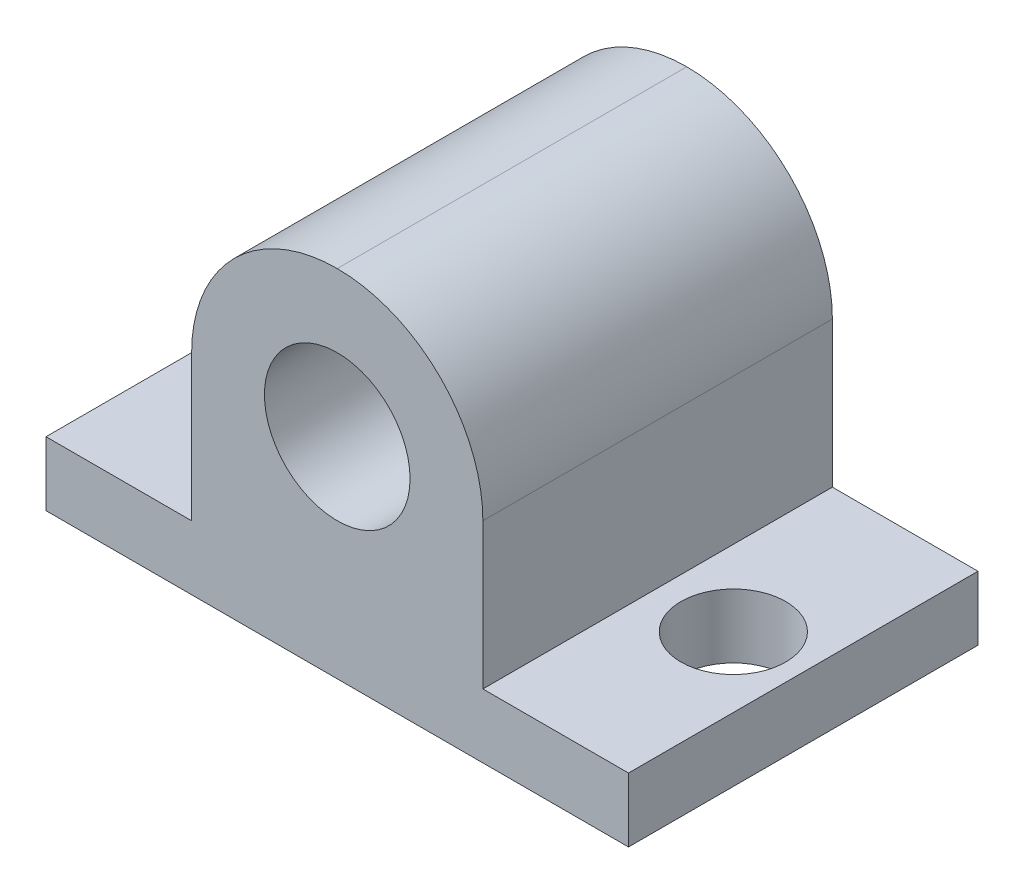
ISO-10303-21;
HEADER;
FILE_DESCRIPTION(('STEP AP214'),'2;1');
FILE_NAME('part.step','',(''),(''),'','','');
FILE_SCHEMA(('AUTOMOTIVE_DESIGN { 1 0 10303 214 1 1 1 1 }'));
ENDSEC;
DATA;
#1=APPLICATION_CONTEXT('core data for automotive mechanical design processes');
#2=APPLICATION_PROTOCOL_DEFINITION('international standard','automotive_design',2000,#1);
#3=PRODUCT_CONTEXT('',#1,'mechanical');
#4=PRODUCT('Part','Part','',(#3));
#5=PRODUCT_RELATED_PRODUCT_CATEGORY('part','',(#4));
#6=PRODUCT_DEFINITION_FORMATION('','',#4);
#7=PRODUCT_DEFINITION_CONTEXT('part definition',#1,'design');
#8=PRODUCT_DEFINITION('design','',#6,#7);
#9=PRODUCT_DEFINITION_SHAPE('','',#8);
#10=(LENGTH_UNIT() NAMED_UNIT(*) SI_UNIT(.MILLI.,.METRE.));
#11=(NAMED_UNIT(*) PLANE_ANGLE_UNIT() SI_UNIT($,.RADIAN.));
#12=(NAMED_UNIT(*) SI_UNIT($,.STERADIAN.) SOLID_ANGLE_UNIT());
#13=UNCERTAINTY_MEASURE_WITH_UNIT(LENGTH_MEASURE(1.E-05),#10,'distance_accuracy_value','');
#14=(GEOMETRIC_REPRESENTATION_CONTEXT(3) GLOBAL_UNCERTAINTY_ASSIGNED_CONTEXT((#13)) GLOBAL_UNIT_ASSIGNED_CONTEXT((#10,
#11,#12)) REPRESENTATION_CONTEXT('',''));
#15=CARTESIAN_POINT('',(0.,0.,0.));
#16=DIRECTION('',(0.,0.,1.));
#17=DIRECTION('',(1.,0.,0.));
#18=AXIS2_PLACEMENT_3D('',#15,#16,#17);
#19=CARTESIAN_POINT('',(0.,2.794,0.));
#20=DIRECTION('',(0.,-1.,0.));
#21=DIRECTION('',(0.,0.,-1.));
#22=AXIS2_PLACEMENT_3D('',#19,#20,#21);
#23=PLANE('',#22);
#24=CARTESIAN_POINT('',(3.04799999999999,2.794,-7.62));
#25=DIRECTION('',(0.,1.,0.));
#26=DIRECTION('',(0.,0.,1.));
#27=AXIS2_PLACEMENT_3D('',#24,#25,#26);
#28=CIRCLE('',#27,2.286);
#29=CARTESIAN_POINT('',(3.04799999999999,2.794,-5.334));
#30=VERTEX_POINT('',#29);
#31=EDGE_CURVE('E205',#30,#30,#28,.T.);
#32=ORIENTED_EDGE('',*,*,#31,.F.);
#33=EDGE_LOOP('',(#32));
#34=FACE_BOUND('',#33,.T.);
#35=DIRECTION('',(0.,0.,1.));
#36=VECTOR('',#35,1.);
#37=CARTESIAN_POINT('',(6.34999999999999,2.794,-15.24));
#38=LINE('',#37,#36);
#39=CARTESIAN_POINT('',(6.34999999999999,2.794,-15.24));
#40=VERTEX_POINT('',#39);
#41=CARTESIAN_POINT('',(6.34999999999999,2.794,0.));
#42=VERTEX_POINT('',#41);
#43=EDGE_CURVE('E126',#40,#42,#38,.T.);
#44=ORIENTED_EDGE('',*,*,#43,.F.);
#45=DIRECTION('',(-1.,0.,0.));
#46=VECTOR('',#45,1.);
#47=CARTESIAN_POINT('',(0.,2.794,-15.24));
#48=LINE('',#47,#46);
#49=CARTESIAN_POINT('',(0.,2.794,-15.24));
#50=VERTEX_POINT('',#49);
#51=EDGE_CURVE('E122',#40,#50,#48,.T.);
#52=ORIENTED_EDGE('',*,*,#51,.T.);
#53=DIRECTION('',(0.,0.,1.));
#54=VECTOR('',#53,1.);
#55=CARTESIAN_POINT('',(0.,2.794,0.));
#56=LINE('',#55,#54);
#57=CARTESIAN_POINT('',(0.,2.794,0.));
#58=VERTEX_POINT('',#57);
#59=EDGE_CURVE('E137',#50,#58,#56,.T.);
#60=ORIENTED_EDGE('',*,*,#59,.T.);
#61=DIRECTION('',(1.,0.,0.));
#62=VECTOR('',#61,1.);
#63=CARTESIAN_POINT('',(0.,2.794,0.));
#64=LINE('',#63,#62);
#65=EDGE_CURVE('E142',#58,#42,#64,.T.);
#66=ORIENTED_EDGE('',*,*,#65,.T.);
#67=EDGE_LOOP('',(#44,#52,#60,#66));
#68=FACE_BOUND('',#67,.T.);
#69=ADVANCED_FACE('F36',(#34,#68),#23,.F.);
#70=CARTESIAN_POINT('',(22.352,2.794,-7.62));
#71=DIRECTION('',(0.,1.,0.));
#72=DIRECTION('',(0.,0.,1.));
#73=AXIS2_PLACEMENT_3D('',#70,#71,#72);
#74=CIRCLE('',#73,2.286);
#75=CARTESIAN_POINT('',(22.352,2.794,-5.334));
#76=VERTEX_POINT('',#75);
#77=EDGE_CURVE('E199',#76,#76,#74,.T.);
#78=ORIENTED_EDGE('',*,*,#77,.F.);
#79=EDGE_LOOP('',(#78));
#80=FACE_BOUND('',#79,.T.);
#81=DIRECTION('',(0.,0.,-1.));
#82=VECTOR('',#81,1.);
#83=CARTESIAN_POINT('',(19.05,2.794,-15.24));
#84=LINE('',#83,#82);
#85=CARTESIAN_POINT('',(19.05,2.794,0.));
#86=VERTEX_POINT('',#85);
#87=CARTESIAN_POINT('',(19.05,2.794,-15.24));
#88=VERTEX_POINT('',#87);
#89=EDGE_CURVE('E116',#86,#88,#84,.T.);
#90=ORIENTED_EDGE('',*,*,#89,.F.);
#91=CARTESIAN_POINT('',(25.4,2.794,0.));
#92=VERTEX_POINT('',#91);
#93=EDGE_CURVE('E140',#86,#92,#64,.T.);
#94=ORIENTED_EDGE('',*,*,#93,.T.);
#95=DIRECTION('',(0.,0.,-1.));
#96=VECTOR('',#95,1.);
#97=CARTESIAN_POINT('',(25.4,2.794,0.));
#98=LINE('',#97,#96);
#99=CARTESIAN_POINT('',(25.4,2.794,-15.24));
#100=VERTEX_POINT('',#99);
#101=EDGE_CURVE('E119',#92,#100,#98,.T.);
#102=ORIENTED_EDGE('',*,*,#101,.T.);
#103=EDGE_CURVE('E106',#100,#88,#48,.T.);
#104=ORIENTED_EDGE('',*,*,#103,.T.);
#105=EDGE_LOOP('',(#90,#94,#102,#104));
#106=FACE_BOUND('',#105,.T.);
#107=ADVANCED_FACE('F115',(#80,#106),#23,.F.);
#108=CARTESIAN_POINT('',(0.,2.794,0.));
#109=DIRECTION('',(1.,0.,0.));
#110=DIRECTION('',(0.,0.,-1.));
#111=AXIS2_PLACEMENT_3D('',#108,#109,#110);
#112=PLANE('',#111);
#113=DIRECTION('',(0.,0.,1.));
#114=VECTOR('',#113,1.);
#115=CARTESIAN_POINT('',(0.,0.,0.));
#116=LINE('',#115,#114);
#117=CARTESIAN_POINT('',(0.,0.,-15.24));
#118=VERTEX_POINT('',#117);
#119=CARTESIAN_POINT('',(0.,0.,0.));
#120=VERTEX_POINT('',#119);
#121=EDGE_CURVE('E136',#118,#120,#116,.T.);
#122=ORIENTED_EDGE('',*,*,#121,.T.);
#123=DIRECTION('',(0.,-1.,0.));
#124=VECTOR('',#123,1.);
#125=CARTESIAN_POINT('',(0.,2.794,0.));
#126=LINE('',#125,#124);
#127=EDGE_CURVE('E160',#58,#120,#126,.T.);
#128=ORIENTED_EDGE('',*,*,#127,.F.);
#129=ORIENTED_EDGE('',*,*,#59,.F.);
#130=DIRECTION('',(0.,-1.,0.));
#131=VECTOR('',#130,1.);
#132=CARTESIAN_POINT('',(0.,2.794,-15.24));
#133=LINE('',#132,#131);
#134=EDGE_CURVE('E121',#50,#118,#133,.T.);
#135=ORIENTED_EDGE('',*,*,#134,.T.);
#136=EDGE_LOOP('',(#122,#128,#129,#135));
#137=FACE_BOUND('',#136,.T.);
#138=ADVANCED_FACE('F226',(#137),#112,.F.);
#139=CARTESIAN_POINT('',(0.,2.794,0.));
#140=DIRECTION('',(0.,0.,-1.));
#141=DIRECTION('',(-1.,0.,0.));
#142=AXIS2_PLACEMENT_3D('',#139,#140,#141);
#143=PLANE('',#142);
#144=CARTESIAN_POINT('',(12.7,9.144,0.));
#145=DIRECTION('',(0.,0.,1.));
#146=DIRECTION('',(1.,0.,0.));
#147=AXIS2_PLACEMENT_3D('',#144,#145,#146);
#148=CIRCLE('',#147,3.175);
#149=CARTESIAN_POINT('',(15.875,9.144,0.));
#150=VERTEX_POINT('',#149);
#151=EDGE_CURVE('E192',#150,#150,#148,.T.);
#152=ORIENTED_EDGE('',*,*,#151,.F.);
#153=EDGE_LOOP('',(#152));
#154=FACE_BOUND('',#153,.T.);
#155=CARTESIAN_POINT('',(12.7,9.144,0.));
#156=DIRECTION('',(0.,0.,-1.));
#157=DIRECTION('',(-1.,0.,0.));
#158=AXIS2_PLACEMENT_3D('',#155,#156,#157);
#159=CIRCLE('',#158,6.35);
#160=CARTESIAN_POINT('',(19.05,9.144,0.));
#161=VERTEX_POINT('',#160);
#162=CARTESIAN_POINT('',(12.7,15.494,0.));
#163=VERTEX_POINT('',#162);
#164=EDGE_CURVE('E163',#161,#163,#159,.F.);
#165=ORIENTED_EDGE('',*,*,#164,.T.);
#166=CARTESIAN_POINT('',(12.7,9.144,0.));
#167=DIRECTION('',(0.,0.,-1.));
#168=DIRECTION('',(-1.,0.,0.));
#169=AXIS2_PLACEMENT_3D('',#166,#167,#168);
#170=CIRCLE('',#169,6.35);
#171=CARTESIAN_POINT('',(6.34999999999999,9.144,0.));
#172=VERTEX_POINT('',#171);
#173=EDGE_CURVE('E165',#163,#172,#170,.F.);
#174=ORIENTED_EDGE('',*,*,#173,.T.);
#175=DIRECTION('',(0.,-1.,0.));
#176=VECTOR('',#175,1.);
#177=CARTESIAN_POINT('',(6.34999999999999,15.494,0.));
#178=LINE('',#177,#176);
#179=EDGE_CURVE('E134',#172,#42,#178,.T.);
#180=ORIENTED_EDGE('',*,*,#179,.T.);
#181=ORIENTED_EDGE('',*,*,#65,.F.);
#182=ORIENTED_EDGE('',*,*,#127,.T.);
#183=DIRECTION('',(1.,0.,0.));
#184=VECTOR('',#183,1.);
#185=CARTESIAN_POINT('',(0.,0.,0.));
#186=LINE('',#185,#184);
#187=CARTESIAN_POINT('',(25.4,0.,0.));
#188=VERTEX_POINT('',#187);
#189=EDGE_CURVE('E148',#120,#188,#186,.T.);
#190=ORIENTED_EDGE('',*,*,#189,.T.);
#191=DIRECTION('',(0.,-1.,0.));
#192=VECTOR('',#191,1.);
#193=CARTESIAN_POINT('',(25.4,2.794,0.));
#194=LINE('',#193,#192);
#195=EDGE_CURVE('E157',#92,#188,#194,.T.);
#196=ORIENTED_EDGE('',*,*,#195,.F.);
#197=ORIENTED_EDGE('',*,*,#93,.F.);
#198=DIRECTION('',(0.,-1.,0.));
#199=VECTOR('',#198,1.);
#200=CARTESIAN_POINT('',(19.05,15.494,0.));
#201=LINE('',#200,#199);
#202=EDGE_CURVE('E110',#161,#86,#201,.T.);
#203=ORIENTED_EDGE('',*,*,#202,.F.);
#204=EDGE_LOOP('',(#165,#174,#180,#181,#182,#190,#196,#197,#203));
#205=FACE_BOUND('',#204,.T.);
#206=ADVANCED_FACE('F184',(#154,#205),#143,.F.);
#207=CARTESIAN_POINT('',(25.4,2.794,0.));
#208=DIRECTION('',(-1.,0.,0.));
#209=DIRECTION('',(0.,0.,1.));
#210=AXIS2_PLACEMENT_3D('',#207,#208,#209);
#211=PLANE('',#210);
#212=DIRECTION('',(0.,0.,-1.));
#213=VECTOR('',#212,1.);
#214=CARTESIAN_POINT('',(25.4,0.,0.));
#215=LINE('',#214,#213);
#216=CARTESIAN_POINT('',(25.4,0.,-15.24));
#217=VERTEX_POINT('',#216);
#218=EDGE_CURVE('E150',#188,#217,#215,.T.);
#219=ORIENTED_EDGE('',*,*,#218,.T.);
#220=DIRECTION('',(0.,-1.,0.));
#221=VECTOR('',#220,1.);
#222=CARTESIAN_POINT('',(25.4,2.794,-15.24));
#223=LINE('',#222,#221);
#224=EDGE_CURVE('E155',#100,#217,#223,.T.);
#225=ORIENTED_EDGE('',*,*,#224,.F.);
#226=ORIENTED_EDGE('',*,*,#101,.F.);
#227=ORIENTED_EDGE('',*,*,#195,.T.);
#228=EDGE_LOOP('',(#219,#225,#226,#227));
#229=FACE_BOUND('',#228,.T.);
#230=ADVANCED_FACE('F235',(#229),#211,.F.);
#231=CARTESIAN_POINT('',(0.,2.794,-15.24));
#232=DIRECTION('',(0.,0.,1.));
#233=DIRECTION('',(1.,0.,0.));
#234=AXIS2_PLACEMENT_3D('',#231,#232,#233);
#235=PLANE('',#234);
#236=CARTESIAN_POINT('',(12.7,9.144,-15.24));
#237=DIRECTION('',(0.,0.,1.));
#238=DIRECTION('',(1.,0.,0.));
#239=AXIS2_PLACEMENT_3D('',#236,#237,#238);
#240=CIRCLE('',#239,3.175);
#241=CARTESIAN_POINT('',(15.875,9.144,-15.24));
#242=VERTEX_POINT('',#241);
#243=EDGE_CURVE('E190',#242,#242,#240,.T.);
#244=ORIENTED_EDGE('',*,*,#243,.T.);
#245=EDGE_LOOP('',(#244));
#246=FACE_BOUND('',#245,.T.);
#247=DIRECTION('',(0.,-1.,0.));
#248=VECTOR('',#247,1.);
#249=CARTESIAN_POINT('',(6.34999999999999,15.494,-15.24));
#250=LINE('',#249,#248);
#251=CARTESIAN_POINT('',(6.34999999999999,9.144,-15.24));
#252=VERTEX_POINT('',#251);
#253=EDGE_CURVE('E111',#252,#40,#250,.T.);
#254=ORIENTED_EDGE('',*,*,#253,.F.);
#255=CARTESIAN_POINT('',(12.7,9.144,-15.24));
#256=DIRECTION('',(0.,0.,1.));
#257=DIRECTION('',(1.,0.,0.));
#258=AXIS2_PLACEMENT_3D('',#255,#256,#257);
#259=CIRCLE('',#258,6.35);
#260=CARTESIAN_POINT('',(12.7,15.494,-15.24));
#261=VERTEX_POINT('',#260);
#262=EDGE_CURVE('E45',#252,#261,#259,.F.);
#263=ORIENTED_EDGE('',*,*,#262,.T.);
#264=CARTESIAN_POINT('',(12.7,9.144,-15.24));
#265=DIRECTION('',(0.,0.,1.));
#266=DIRECTION('',(1.,0.,0.));
#267=AXIS2_PLACEMENT_3D('',#264,#265,#266);
#268=CIRCLE('',#267,6.35);
#269=CARTESIAN_POINT('',(19.05,9.144,-15.24));
#270=VERTEX_POINT('',#269);
#271=EDGE_CURVE('E52',#261,#270,#268,.F.);
#272=ORIENTED_EDGE('',*,*,#271,.T.);
#273=DIRECTION('',(0.,-1.,0.));
#274=VECTOR('',#273,1.);
#275=CARTESIAN_POINT('',(19.05,15.494,-15.24));
#276=LINE('',#275,#274);
#277=EDGE_CURVE('E102',#270,#88,#276,.T.);
#278=ORIENTED_EDGE('',*,*,#277,.T.);
#279=ORIENTED_EDGE('',*,*,#103,.F.);
#280=ORIENTED_EDGE('',*,*,#224,.T.);
#281=DIRECTION('',(-1.,0.,0.));
#282=VECTOR('',#281,1.);
#283=CARTESIAN_POINT('',(0.,0.,-15.24));
#284=LINE('',#283,#282);
#285=EDGE_CURVE('E141',#217,#118,#284,.T.);
#286=ORIENTED_EDGE('',*,*,#285,.T.);
#287=ORIENTED_EDGE('',*,*,#134,.F.);
#288=ORIENTED_EDGE('',*,*,#51,.F.);
#289=EDGE_LOOP('',(#254,#263,#272,#278,#279,#280,#286,#287,#288));
#290=FACE_BOUND('',#289,.T.);
#291=ADVANCED_FACE('F104',(#246,#290),#235,.F.);
#292=CARTESIAN_POINT('',(0.,0.,0.));
#293=DIRECTION('',(0.,-1.,0.));
#294=DIRECTION('',(0.,0.,-1.));
#295=AXIS2_PLACEMENT_3D('',#292,#293,#294);
#296=PLANE('',#295);
#297=CARTESIAN_POINT('',(3.04799999999999,0.,-7.62));
#298=DIRECTION('',(0.,1.,0.));
#299=DIRECTION('',(0.,0.,1.));
#300=AXIS2_PLACEMENT_3D('',#297,#298,#299);
#301=CIRCLE('',#300,2.286);
#302=CARTESIAN_POINT('',(3.04799999999999,0.,-5.334));
#303=VERTEX_POINT('',#302);
#304=EDGE_CURVE('E197',#303,#303,#301,.T.);
#305=ORIENTED_EDGE('',*,*,#304,.T.);
#306=EDGE_LOOP('',(#305));
#307=FACE_BOUND('',#306,.T.);
#308=CARTESIAN_POINT('',(22.352,0.,-7.62));
#309=DIRECTION('',(0.,1.,0.));
#310=DIRECTION('',(0.,0.,1.));
#311=AXIS2_PLACEMENT_3D('',#308,#309,#310);
#312=CIRCLE('',#311,2.286);
#313=CARTESIAN_POINT('',(22.352,0.,-5.334));
#314=VERTEX_POINT('',#313);
#315=EDGE_CURVE('E202',#314,#314,#312,.T.);
#316=ORIENTED_EDGE('',*,*,#315,.T.);
#317=EDGE_LOOP('',(#316));
#318=FACE_BOUND('',#317,.T.);
#319=ORIENTED_EDGE('',*,*,#121,.F.);
#320=ORIENTED_EDGE('',*,*,#285,.F.);
#321=ORIENTED_EDGE('',*,*,#218,.F.);
#322=ORIENTED_EDGE('',*,*,#189,.F.);
#323=EDGE_LOOP('',(#319,#320,#321,#322));
#324=FACE_BOUND('',#323,.T.);
#325=ADVANCED_FACE('F211',(#307,#318,#324),#296,.T.);
#326=CARTESIAN_POINT('',(6.34999999999999,15.494,-15.24));
#327=DIRECTION('',(1.,0.,0.));
#328=DIRECTION('',(0.,0.,-1.));
#329=AXIS2_PLACEMENT_3D('',#326,#327,#328);
#330=PLANE('',#329);
#331=ORIENTED_EDGE('',*,*,#179,.F.);
#332=DIRECTION('',(0.,0.,1.));
#333=VECTOR('',#332,1.);
#334=CARTESIAN_POINT('',(6.34999999999999,9.144,-15.24));
#335=LINE('',#334,#333);
#336=EDGE_CURVE('E167',#172,#252,#335,.F.);
#337=ORIENTED_EDGE('',*,*,#336,.T.);
#338=ORIENTED_EDGE('',*,*,#253,.T.);
#339=ORIENTED_EDGE('',*,*,#43,.T.);
#340=EDGE_LOOP('',(#331,#337,#338,#339));
#341=FACE_BOUND('',#340,.T.);
#342=ADVANCED_FACE('F174',(#341),#330,.F.);
#343=CARTESIAN_POINT('',(19.05,15.494,-15.24));
#344=DIRECTION('',(-1.,0.,0.));
#345=DIRECTION('',(0.,0.,1.));
#346=AXIS2_PLACEMENT_3D('',#343,#344,#345);
#347=PLANE('',#346);
#348=ORIENTED_EDGE('',*,*,#277,.F.);
#349=DIRECTION('',(0.,0.,-1.));
#350=VECTOR('',#349,1.);
#351=CARTESIAN_POINT('',(19.05,9.144,0.));
#352=LINE('',#351,#350);
#353=EDGE_CURVE('E11',#270,#161,#352,.F.);
#354=ORIENTED_EDGE('',*,*,#353,.T.);
#355=ORIENTED_EDGE('',*,*,#202,.T.);
#356=ORIENTED_EDGE('',*,*,#89,.T.);
#357=EDGE_LOOP('',(#348,#354,#355,#356));
#358=FACE_BOUND('',#357,.T.);
#359=ADVANCED_FACE('F124',(#358),#347,.F.);
#360=CARTESIAN_POINT('',(12.7,9.144,0.));
#361=DIRECTION('',(0.,0.,1.));
#362=DIRECTION('',(1.,0.,0.));
#363=AXIS2_PLACEMENT_3D('',#360,#361,#362);
#364=CYLINDRICAL_SURFACE('',#363,6.35);
#365=ORIENTED_EDGE('',*,*,#353,.F.);
#366=ORIENTED_EDGE('',*,*,#271,.F.);
#367=DIRECTION('',(0.,0.,-1.));
#368=VECTOR('',#367,1.);
#369=CARTESIAN_POINT('',(12.7,15.494,-15.24));
#370=LINE('',#369,#368);
#371=EDGE_CURVE('E40',#163,#261,#370,.T.);
#372=ORIENTED_EDGE('',*,*,#371,.F.);
#373=ORIENTED_EDGE('',*,*,#164,.F.);
#374=EDGE_LOOP('',(#365,#366,#372,#373));
#375=FACE_BOUND('',#374,.T.);
#376=ADVANCED_FACE('F38',(#375),#364,.T.);
#377=CARTESIAN_POINT('',(12.7,9.144,0.));
#378=DIRECTION('',(0.,0.,-1.));
#379=DIRECTION('',(-1.,0.,0.));
#380=AXIS2_PLACEMENT_3D('',#377,#378,#379);
#381=CYLINDRICAL_SURFACE('',#380,6.35);
#382=ORIENTED_EDGE('',*,*,#262,.F.);
#383=ORIENTED_EDGE('',*,*,#336,.F.);
#384=ORIENTED_EDGE('',*,*,#173,.F.);
#385=ORIENTED_EDGE('',*,*,#371,.T.);
#386=EDGE_LOOP('',(#382,#383,#384,#385));
#387=FACE_BOUND('',#386,.T.);
#388=ADVANCED_FACE('F188',(#387),#381,.T.);
#389=CARTESIAN_POINT('',(12.7,9.144,-15.24));
#390=DIRECTION('',(0.,0.,1.));
#391=DIRECTION('',(1.,0.,0.));
#392=AXIS2_PLACEMENT_3D('',#389,#390,#391);
#393=CYLINDRICAL_SURFACE('',#392,3.175);
#394=CARTESIAN_POINT('',(15.875,9.144,-15.24));
#395=CARTESIAN_POINT('',(15.875,9.144,-15.08125));
#396=CARTESIAN_POINT('',(15.875,9.144,-14.9225));
#397=CARTESIAN_POINT('',(15.875,9.144,-14.605));
#398=CARTESIAN_POINT('',(15.875,9.144,-14.44625));
#399=CARTESIAN_POINT('',(15.875,9.144,-14.12875));
#400=CARTESIAN_POINT('',(15.875,9.144,-13.97));
#401=CARTESIAN_POINT('',(15.875,9.144,-13.6525));
#402=CARTESIAN_POINT('',(15.875,9.144,-13.49375));
#403=CARTESIAN_POINT('',(15.875,9.144,-13.17625));
#404=CARTESIAN_POINT('',(15.875,9.144,-13.0175));
#405=CARTESIAN_POINT('',(15.875,9.144,-12.7));
#406=CARTESIAN_POINT('',(15.875,9.144,-12.54125));
#407=CARTESIAN_POINT('',(15.875,9.144,-12.22375));
#408=CARTESIAN_POINT('',(15.875,9.144,-12.065));
#409=CARTESIAN_POINT('',(15.875,9.144,-11.7475));
#410=CARTESIAN_POINT('',(15.875,9.144,-11.58875));
#411=CARTESIAN_POINT('',(15.875,9.144,-11.27125));
#412=CARTESIAN_POINT('',(15.875,9.144,-11.1125));
#413=CARTESIAN_POINT('',(15.875,9.144,-10.795));
#414=CARTESIAN_POINT('',(15.875,9.144,-10.63625));
#415=CARTESIAN_POINT('',(15.875,9.144,-10.31875));
#416=CARTESIAN_POINT('',(15.875,9.144,-10.16));
#417=CARTESIAN_POINT('',(15.875,9.144,-9.8425));
#418=CARTESIAN_POINT('',(15.875,9.144,-9.68375));
#419=CARTESIAN_POINT('',(15.875,9.144,-9.36625));
#420=CARTESIAN_POINT('',(15.875,9.144,-9.2075));
#421=CARTESIAN_POINT('',(15.875,9.144,-8.89));
#422=CARTESIAN_POINT('',(15.875,9.144,-8.73125));
#423=CARTESIAN_POINT('',(15.875,9.144,-8.41375));
#424=CARTESIAN_POINT('',(15.875,9.144,-8.255));
#425=CARTESIAN_POINT('',(15.875,9.144,-7.9375));
#426=CARTESIAN_POINT('',(15.875,9.144,-7.77875));
#427=CARTESIAN_POINT('',(15.875,9.144,-7.46125));
#428=CARTESIAN_POINT('',(15.875,9.144,-7.3025));
#429=CARTESIAN_POINT('',(15.875,9.144,-6.985));
#430=CARTESIAN_POINT('',(15.875,9.144,-6.82625));
#431=CARTESIAN_POINT('',(15.875,9.144,-6.50875));
#432=CARTESIAN_POINT('',(15.875,9.144,-6.35));
#433=CARTESIAN_POINT('',(15.875,9.144,-6.0325));
#434=CARTESIAN_POINT('',(15.875,9.144,-5.87375));
#435=CARTESIAN_POINT('',(15.875,9.144,-5.55625));
#436=CARTESIAN_POINT('',(15.875,9.144,-5.3975));
#437=CARTESIAN_POINT('',(15.875,9.144,-5.08));
#438=CARTESIAN_POINT('',(15.875,9.144,-4.92125));
#439=CARTESIAN_POINT('',(15.875,9.144,-4.60375));
#440=CARTESIAN_POINT('',(15.875,9.144,-4.445));
#441=CARTESIAN_POINT('',(15.875,9.144,-4.1275));
#442=CARTESIAN_POINT('',(15.875,9.144,-3.96875));
#443=CARTESIAN_POINT('',(15.875,9.144,-3.65125));
#444=CARTESIAN_POINT('',(15.875,9.144,-3.4925));
#445=CARTESIAN_POINT('',(15.875,9.144,-3.175));
#446=CARTESIAN_POINT('',(15.875,9.144,-3.01625));
#447=CARTESIAN_POINT('',(15.875,9.144,-2.69875));
#448=CARTESIAN_POINT('',(15.875,9.144,-2.54));
#449=CARTESIAN_POINT('',(15.875,9.144,-2.2225));
#450=CARTESIAN_POINT('',(15.875,9.144,-2.06375));
#451=CARTESIAN_POINT('',(15.875,9.144,-1.74625));
#452=CARTESIAN_POINT('',(15.875,9.144,-1.5875));
#453=CARTESIAN_POINT('',(15.875,9.144,-1.27));
#454=CARTESIAN_POINT('',(15.875,9.144,-1.11125));
#455=CARTESIAN_POINT('',(15.875,9.144,-0.79375));
#456=CARTESIAN_POINT('',(15.875,9.144,-0.634999999999999));
#457=CARTESIAN_POINT('',(15.875,9.144,-0.3175));
#458=CARTESIAN_POINT('',(15.875,9.144,-0.15875));
#459=CARTESIAN_POINT('',(15.875,9.144,0.));
#460=B_SPLINE_CURVE_WITH_KNOTS('',3,(#394,#395,#396,#397,#398,#399,#400,#401,#402,#403,#404,
#405,#406,#407,#408,#409,#410,#411,#412,#413,#414,#415,#416,#417,#418,#419,#420,#421,#422,#423,
#424,#425,#426,#427,#428,#429,#430,#431,#432,#433,#434,#435,#436,#437,#438,#439,#440,#441,#442,
#443,#444,#445,#446,#447,#448,#449,#450,#451,#452,#453,#454,#455,#456,#457,#458,#459),
.UNSPECIFIED.,.F.,.F.,(4,2,2,2,2,2,2,2,2,2,2,2,2,2,2,2,2,2,2,2,2,2,2,2,2,2,2,2,2,2,2,2,4),(0.,
0.476250000000001,0.9525,1.42875,1.905,2.38125,2.8575,3.33375,3.81,4.28625,4.7625,5.23875,5.715,
6.19125,6.6675,7.14375,7.62,8.09625,8.5725,9.04875,9.525,10.00125,10.4775,10.95375,11.43,
11.90625,12.3825,12.85875,13.335,13.81125,14.2875,14.76375,15.24),.UNSPECIFIED.);
#461=EDGE_CURVE('BSEAM245',#242,#150,#460,.T.);
#462=ORIENTED_EDGE('',*,*,#243,.F.);
#463=ORIENTED_EDGE('',*,*,#151,.T.);
#464=ORIENTED_EDGE('',*,*,#461,.T.);
#465=ORIENTED_EDGE('',*,*,#461,.F.);
#466=EDGE_LOOP('',(#462,#464,#463,#465));
#467=FACE_BOUND('',#466,.T.);
#468=ADVANCED_FACE('F245',(#467),#393,.F.);
#469=CARTESIAN_POINT('',(22.352,0.,-7.62));
#470=DIRECTION('',(0.,1.,0.));
#471=DIRECTION('',(0.,0.,1.));
#472=AXIS2_PLACEMENT_3D('',#469,#470,#471);
#473=CYLINDRICAL_SURFACE('',#472,2.286);
#474=ORIENTED_EDGE('',*,*,#315,.F.);
#475=EDGE_LOOP('',(#474));
#476=FACE_BOUND('',#475,.T.);
#477=ORIENTED_EDGE('',*,*,#77,.T.);
#478=EDGE_LOOP('',(#477));
#479=FACE_BOUND('',#478,.T.);
#480=ADVANCED_FACE('F217',(#476,#479),#473,.F.);
#481=CARTESIAN_POINT('',(3.04799999999999,0.,-7.62));
#482=DIRECTION('',(0.,1.,0.));
#483=DIRECTION('',(0.,0.,1.));
#484=AXIS2_PLACEMENT_3D('',#481,#482,#483);
#485=CYLINDRICAL_SURFACE('',#484,2.286);
#486=ORIENTED_EDGE('',*,*,#304,.F.);
#487=EDGE_LOOP('',(#486));
#488=FACE_BOUND('',#487,.T.);
#489=ORIENTED_EDGE('',*,*,#31,.T.);
#490=EDGE_LOOP('',(#489));
#491=FACE_BOUND('',#490,.T.);
#492=ADVANCED_FACE('F214',(#488,#491),#485,.F.);
#493=CLOSED_SHELL('',(#69,#107,#138,#206,#230,#291,#325,#342,#359,#376,#388,#468,#480,#492));
#494=MANIFOLD_SOLID_BREP('B2',#493);
#495=ADVANCED_BREP_SHAPE_REPRESENTATION('',(#18,#494),#14);
#496=SHAPE_DEFINITION_REPRESENTATION(#9,#495);
ENDSEC;
END-ISO-10303-21;
